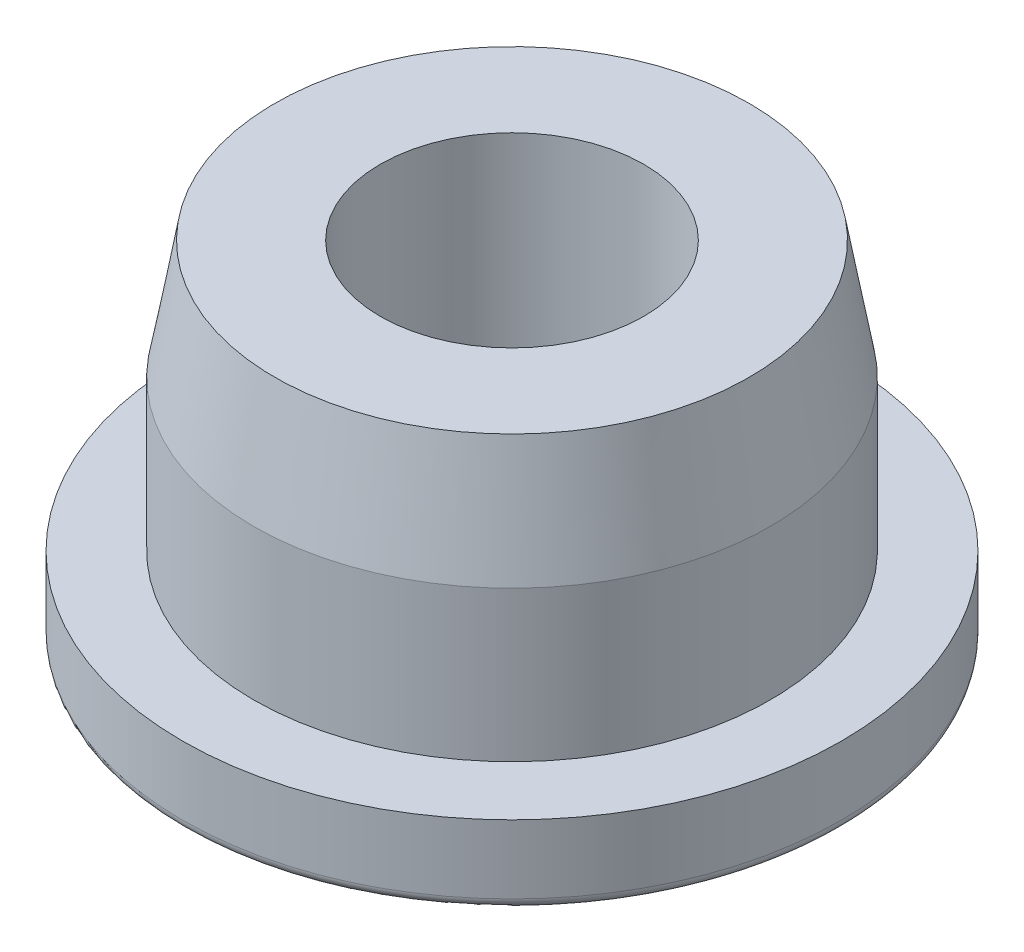
ISO-10303-21;
HEADER;
FILE_DESCRIPTION(('STEP AP214'),'2;1');
FILE_NAME('part.step','',(''),(''),'','','');
FILE_SCHEMA(('AUTOMOTIVE_DESIGN { 1 0 10303 214 1 1 1 1 }'));
ENDSEC;
DATA;
#1=APPLICATION_CONTEXT('core data for automotive mechanical design processes');
#2=APPLICATION_PROTOCOL_DEFINITION('international standard','automotive_design',2000,#1);
#3=PRODUCT_CONTEXT('',#1,'mechanical');
#4=PRODUCT('Part','Part','',(#3));
#5=PRODUCT_RELATED_PRODUCT_CATEGORY('part','',(#4));
#6=PRODUCT_DEFINITION_FORMATION('','',#4);
#7=PRODUCT_DEFINITION_CONTEXT('part definition',#1,'design');
#8=PRODUCT_DEFINITION('design','',#6,#7);
#9=PRODUCT_DEFINITION_SHAPE('','',#8);
#10=(LENGTH_UNIT() NAMED_UNIT(*) SI_UNIT(.MILLI.,.METRE.));
#11=(NAMED_UNIT(*) PLANE_ANGLE_UNIT() SI_UNIT($,.RADIAN.));
#12=(NAMED_UNIT(*) SI_UNIT($,.STERADIAN.) SOLID_ANGLE_UNIT());
#13=UNCERTAINTY_MEASURE_WITH_UNIT(LENGTH_MEASURE(1.E-05),#10,'distance_accuracy_value','');
#14=(GEOMETRIC_REPRESENTATION_CONTEXT(3) GLOBAL_UNCERTAINTY_ASSIGNED_CONTEXT((#13)) GLOBAL_UNIT_ASSIGNED_CONTEXT((#10,
#11,#12)) REPRESENTATION_CONTEXT('',''));
#15=CARTESIAN_POINT('',(0.,0.,0.));
#16=DIRECTION('',(0.,0.,1.));
#17=DIRECTION('',(1.,0.,0.));
#18=AXIS2_PLACEMENT_3D('',#15,#16,#17);
#19=CARTESIAN_POINT('',(0.,0.,0.));
#20=DIRECTION('',(0.,1.,0.));
#21=DIRECTION('',(0.,0.,1.));
#22=AXIS2_PLACEMENT_3D('',#19,#20,#21);
#23=PLANE('',#22);
#24=CARTESIAN_POINT('',(0.,0.,0.));
#25=DIRECTION('',(0.,1.,0.));
#26=DIRECTION('',(0.,0.,1.));
#27=AXIS2_PLACEMENT_3D('',#24,#25,#26);
#28=CIRCLE('',#27,12.1);
#29=CARTESIAN_POINT('',(0.,0.,12.1));
#30=VERTEX_POINT('',#29);
#31=EDGE_CURVE('E37',#30,#30,#28,.F.);
#32=ORIENTED_EDGE('',*,*,#31,.T.);
#33=EDGE_LOOP('',(#32));
#34=FACE_BOUND('',#33,.T.);
#35=ADVANCED_FACE('F30',(#34),#23,.F.);
#36=CARTESIAN_POINT('',(0.,0.,0.));
#37=DIRECTION('',(0.,-1.,0.));
#38=DIRECTION('',(0.,0.,-1.));
#39=AXIS2_PLACEMENT_3D('',#36,#37,#38);
#40=CYLINDRICAL_SURFACE('',#39,12.5);
#41=CARTESIAN_POINT('',(0.,0.4,0.));
#42=DIRECTION('',(0.,1.,0.));
#43=DIRECTION('',(0.,0.,1.));
#44=AXIS2_PLACEMENT_3D('',#41,#42,#43);
#45=CIRCLE('',#44,12.5);
#46=CARTESIAN_POINT('',(0.,0.4,12.5));
#47=VERTEX_POINT('',#46);
#48=EDGE_CURVE('E10',#47,#47,#45,.T.);
#49=ORIENTED_EDGE('',*,*,#48,.T.);
#50=EDGE_LOOP('',(#49));
#51=FACE_BOUND('',#50,.T.);
#52=CARTESIAN_POINT('',(0.,3.,0.));
#53=DIRECTION('',(0.,-1.,0.));
#54=DIRECTION('',(0.,0.,-1.));
#55=AXIS2_PLACEMENT_3D('',#52,#53,#54);
#56=CIRCLE('',#55,12.5);
#57=CARTESIAN_POINT('',(0.,3.,-12.5));
#58=VERTEX_POINT('',#57);
#59=EDGE_CURVE('E41',#58,#58,#56,.T.);
#60=ORIENTED_EDGE('',*,*,#59,.T.);
#61=EDGE_LOOP('',(#60));
#62=FACE_BOUND('',#61,.T.);
#63=ADVANCED_FACE('F77',(#51,#62),#40,.T.);
#64=CARTESIAN_POINT('',(0.,3.,12.5));
#65=DIRECTION('',(0.,-1.,0.));
#66=DIRECTION('',(0.,0.,-1.));
#67=AXIS2_PLACEMENT_3D('',#64,#65,#66);
#68=PLANE('',#67);
#69=ORIENTED_EDGE('',*,*,#59,.F.);
#70=EDGE_LOOP('',(#69));
#71=FACE_BOUND('',#70,.T.);
#72=CARTESIAN_POINT('',(0.,3.,0.));
#73=DIRECTION('',(0.,-1.,0.));
#74=DIRECTION('',(0.,0.,-1.));
#75=AXIS2_PLACEMENT_3D('',#72,#73,#74);
#76=CIRCLE('',#75,9.8);
#77=CARTESIAN_POINT('',(0.,3.,-9.8));
#78=VERTEX_POINT('',#77);
#79=EDGE_CURVE('E45',#78,#78,#76,.T.);
#80=ORIENTED_EDGE('',*,*,#79,.T.);
#81=EDGE_LOOP('',(#80));
#82=FACE_BOUND('',#81,.T.);
#83=ADVANCED_FACE('F81',(#71,#82),#68,.F.);
#84=CARTESIAN_POINT('',(0.,0.,0.));
#85=DIRECTION('',(0.,-1.,0.));
#86=DIRECTION('',(0.,0.,-1.));
#87=AXIS2_PLACEMENT_3D('',#84,#85,#86);
#88=CYLINDRICAL_SURFACE('',#87,9.8);
#89=ORIENTED_EDGE('',*,*,#79,.F.);
#90=EDGE_LOOP('',(#89));
#91=FACE_BOUND('',#90,.T.);
#92=CARTESIAN_POINT('',(0.,8.7,0.));
#93=DIRECTION('',(0.,-1.,0.));
#94=DIRECTION('',(0.,0.,-1.));
#95=AXIS2_PLACEMENT_3D('',#92,#93,#94);
#96=CIRCLE('',#95,9.8);
#97=CARTESIAN_POINT('',(0.,8.7,-9.8));
#98=VERTEX_POINT('',#97);
#99=EDGE_CURVE('E50',#98,#98,#96,.T.);
#100=ORIENTED_EDGE('',*,*,#99,.T.);
#101=EDGE_LOOP('',(#100));
#102=FACE_BOUND('',#101,.T.);
#103=ADVANCED_FACE('F86',(#91,#102),#88,.T.);
#104=CARTESIAN_POINT('',(0.,13.2,0.));
#105=DIRECTION('',(0.,-1.,0.));
#106=DIRECTION('',(0.,0.,-1.));
#107=AXIS2_PLACEMENT_3D('',#104,#105,#106);
#108=CONICAL_SURFACE('',#107,9.,0.175939625452528);
#109=ORIENTED_EDGE('',*,*,#99,.F.);
#110=EDGE_LOOP('',(#109));
#111=FACE_BOUND('',#110,.T.);
#112=CARTESIAN_POINT('',(0.,13.2,0.));
#113=DIRECTION('',(0.,-1.,0.));
#114=DIRECTION('',(0.,0.,-1.));
#115=AXIS2_PLACEMENT_3D('',#112,#113,#114);
#116=CIRCLE('',#115,9.);
#117=CARTESIAN_POINT('',(0.,13.2,-9.));
#118=VERTEX_POINT('',#117);
#119=EDGE_CURVE('E53',#118,#118,#116,.T.);
#120=ORIENTED_EDGE('',*,*,#119,.T.);
#121=EDGE_LOOP('',(#120));
#122=FACE_BOUND('',#121,.T.);
#123=ADVANCED_FACE('F90',(#111,#122),#108,.T.);
#124=CARTESIAN_POINT('',(0.,13.2,9.));
#125=DIRECTION('',(0.,-1.,0.));
#126=DIRECTION('',(0.,0.,-1.));
#127=AXIS2_PLACEMENT_3D('',#124,#125,#126);
#128=PLANE('',#127);
#129=ORIENTED_EDGE('',*,*,#119,.F.);
#130=EDGE_LOOP('',(#129));
#131=FACE_BOUND('',#130,.T.);
#132=CARTESIAN_POINT('',(0.,13.2,0.));
#133=DIRECTION('',(0.,-1.,0.));
#134=DIRECTION('',(0.,0.,-1.));
#135=AXIS2_PLACEMENT_3D('',#132,#133,#134);
#136=CIRCLE('',#135,5.);
#137=CARTESIAN_POINT('',(0.,13.2,-5.));
#138=VERTEX_POINT('',#137);
#139=EDGE_CURVE('E56',#138,#138,#136,.T.);
#140=ORIENTED_EDGE('',*,*,#139,.T.);
#141=EDGE_LOOP('',(#140));
#142=FACE_BOUND('',#141,.T.);
#143=ADVANCED_FACE('F73',(#131,#142),#128,.F.);
#144=CARTESIAN_POINT('',(0.,0.,0.));
#145=DIRECTION('',(0.,-1.,0.));
#146=DIRECTION('',(0.,0.,-1.));
#147=AXIS2_PLACEMENT_3D('',#144,#145,#146);
#148=CYLINDRICAL_SURFACE('',#147,5.);
#149=ORIENTED_EDGE('',*,*,#139,.F.);
#150=EDGE_LOOP('',(#149));
#151=FACE_BOUND('',#150,.T.);
#152=CARTESIAN_POINT('',(0.,2.8,0.));
#153=DIRECTION('',(0.,-1.,0.));
#154=DIRECTION('',(0.,0.,-1.));
#155=AXIS2_PLACEMENT_3D('',#152,#153,#154);
#156=CIRCLE('',#155,5.);
#157=CARTESIAN_POINT('',(0.,2.8,-5.));
#158=VERTEX_POINT('',#157);
#159=EDGE_CURVE('E59',#158,#158,#156,.T.);
#160=ORIENTED_EDGE('',*,*,#159,.T.);
#161=EDGE_LOOP('',(#160));
#162=FACE_BOUND('',#161,.T.);
#163=ADVANCED_FACE('F63',(#151,#162),#148,.F.);
#164=CARTESIAN_POINT('',(0.,2.8,5.));
#165=DIRECTION('',(0.,-1.,0.));
#166=DIRECTION('',(0.,0.,-1.));
#167=AXIS2_PLACEMENT_3D('',#164,#165,#166);
#168=PLANE('',#167);
#169=ORIENTED_EDGE('',*,*,#159,.F.);
#170=EDGE_LOOP('',(#169));
#171=FACE_BOUND('',#170,.T.);
#172=ADVANCED_FACE('F65',(#171),#168,.F.);
#173=CARTESIAN_POINT('',(0.,0.4,0.));
#174=DIRECTION('',(0.,1.,0.));
#175=DIRECTION('',(0.,0.,1.));
#176=AXIS2_PLACEMENT_3D('',#173,#174,#175);
#177=TOROIDAL_SURFACE('',#176,12.1,0.4);
#178=ORIENTED_EDGE('',*,*,#48,.F.);
#179=EDGE_LOOP('',(#178));
#180=FACE_BOUND('',#179,.T.);
#181=ORIENTED_EDGE('',*,*,#31,.F.);
#182=EDGE_LOOP('',(#181));
#183=FACE_BOUND('',#182,.T.);
#184=ADVANCED_FACE('F32',(#180,#183),#177,.T.);
#185=CLOSED_SHELL('',(#35,#63,#83,#103,#123,#143,#163,#172,#184));
#186=MANIFOLD_SOLID_BREP('B2',#185);
#187=ADVANCED_BREP_SHAPE_REPRESENTATION('',(#18,#186),#14);
#188=SHAPE_DEFINITION_REPRESENTATION(#9,#187);
ENDSEC;
END-ISO-10303-21;
